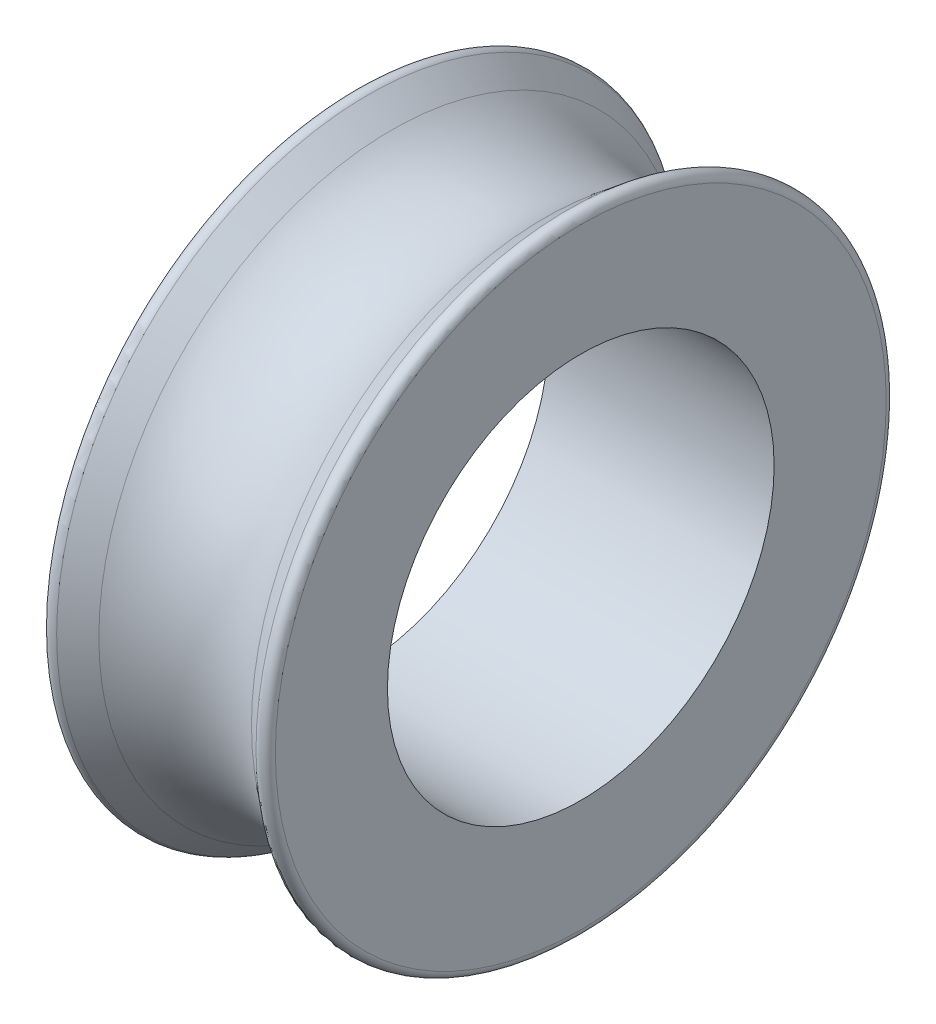
ISO-10303-21;
HEADER;
FILE_DESCRIPTION(('STEP AP214'),'2;1');
FILE_NAME('part.step','',(''),(''),'','','');
FILE_SCHEMA(('AUTOMOTIVE_DESIGN { 1 0 10303 214 1 1 1 1 }'));
ENDSEC;
DATA;
#1=APPLICATION_CONTEXT('core data for automotive mechanical design processes');
#2=APPLICATION_PROTOCOL_DEFINITION('international standard','automotive_design',2000,#1);
#3=PRODUCT_CONTEXT('',#1,'mechanical');
#4=PRODUCT('Part','Part','',(#3));
#5=PRODUCT_RELATED_PRODUCT_CATEGORY('part','',(#4));
#6=PRODUCT_DEFINITION_FORMATION('','',#4);
#7=PRODUCT_DEFINITION_CONTEXT('part definition',#1,'design');
#8=PRODUCT_DEFINITION('design','',#6,#7);
#9=PRODUCT_DEFINITION_SHAPE('','',#8);
#10=(LENGTH_UNIT() NAMED_UNIT(*) SI_UNIT(.MILLI.,.METRE.));
#11=(NAMED_UNIT(*) PLANE_ANGLE_UNIT() SI_UNIT($,.RADIAN.));
#12=(NAMED_UNIT(*) SI_UNIT($,.STERADIAN.) SOLID_ANGLE_UNIT());
#13=UNCERTAINTY_MEASURE_WITH_UNIT(LENGTH_MEASURE(1.E-05),#10,'distance_accuracy_value','');
#14=(GEOMETRIC_REPRESENTATION_CONTEXT(3) GLOBAL_UNCERTAINTY_ASSIGNED_CONTEXT((#13)) GLOBAL_UNIT_ASSIGNED_CONTEXT((#10,
#11,#12)) REPRESENTATION_CONTEXT('',''));
#15=CARTESIAN_POINT('',(0.,0.,0.));
#16=DIRECTION('',(0.,0.,1.));
#17=DIRECTION('',(1.,0.,0.));
#18=AXIS2_PLACEMENT_3D('',#15,#16,#17);
#19=CARTESIAN_POINT('',(0.,10.,0.));
#20=DIRECTION('',(1.,0.,0.));
#21=DIRECTION('',(0.,0.,-1.));
#22=AXIS2_PLACEMENT_3D('',#19,#20,#21);
#23=PLANE('',#22);
#24=CARTESIAN_POINT('',(0.,0.,0.));
#25=DIRECTION('',(-1.,0.,0.));
#26=DIRECTION('',(0.,0.,1.));
#27=AXIS2_PLACEMENT_3D('',#24,#25,#26);
#28=CIRCLE('',#27,6.);
#29=CARTESIAN_POINT('',(0.,0.,6.));
#30=VERTEX_POINT('',#29);
#31=EDGE_CURVE('E66',#30,#30,#28,.T.);
#32=ORIENTED_EDGE('',*,*,#31,.F.);
#33=EDGE_LOOP('',(#32));
#34=FACE_BOUND('',#33,.T.);
#35=CARTESIAN_POINT('',(0.,0.,0.));
#36=DIRECTION('',(1.,0.,0.));
#37=DIRECTION('',(0.,0.,-1.));
#38=AXIS2_PLACEMENT_3D('',#35,#36,#37);
#39=CIRCLE('',#38,9.47735357758255);
#40=CARTESIAN_POINT('',(0.,0.,-9.47735357758255));
#41=VERTEX_POINT('',#40);
#42=EDGE_CURVE('E44',#41,#41,#39,.F.);
#43=ORIENTED_EDGE('',*,*,#42,.T.);
#44=EDGE_LOOP('',(#43));
#45=FACE_BOUND('',#44,.T.);
#46=ADVANCED_FACE('F37',(#34,#45),#23,.F.);
#47=CARTESIAN_POINT('',(7.,0.,0.));
#48=DIRECTION('',(-1.,0.,0.));
#49=DIRECTION('',(0.,0.,1.));
#50=AXIS2_PLACEMENT_3D('',#47,#48,#49);
#51=PLANE('',#50);
#52=CARTESIAN_POINT('',(7.,0.,0.));
#53=DIRECTION('',(-1.,0.,0.));
#54=DIRECTION('',(0.,0.,1.));
#55=AXIS2_PLACEMENT_3D('',#52,#53,#54);
#56=CIRCLE('',#55,6.);
#57=CARTESIAN_POINT('',(7.,0.,6.));
#58=VERTEX_POINT('',#57);
#59=EDGE_CURVE('E63',#58,#58,#56,.F.);
#60=ORIENTED_EDGE('',*,*,#59,.F.);
#61=EDGE_LOOP('',(#60));
#62=FACE_BOUND('',#61,.T.);
#63=CARTESIAN_POINT('',(7.,0.,0.));
#64=DIRECTION('',(-1.,0.,0.));
#65=DIRECTION('',(0.,0.,1.));
#66=AXIS2_PLACEMENT_3D('',#63,#64,#65);
#67=CIRCLE('',#66,9.47735357758256);
#68=CARTESIAN_POINT('',(7.,0.,9.47735357758256));
#69=VERTEX_POINT('',#68);
#70=EDGE_CURVE('E48',#69,#69,#67,.F.);
#71=ORIENTED_EDGE('',*,*,#70,.T.);
#72=EDGE_LOOP('',(#71));
#73=FACE_BOUND('',#72,.T.);
#74=ADVANCED_FACE('F74',(#62,#73),#51,.F.);
#75=CARTESIAN_POINT('',(7.,0.,0.));
#76=DIRECTION('',(1.,0.,0.));
#77=DIRECTION('',(0.,0.,-1.));
#78=AXIS2_PLACEMENT_3D('',#75,#76,#77);
#79=CONICAL_SURFACE('',#78,10.,0.678464808980954);
#80=CARTESIAN_POINT('',(6.59310035978507,0.,0.));
#81=DIRECTION('',(-1.,0.,0.));
#82=DIRECTION('',(0.,0.,1.));
#83=AXIS2_PLACEMENT_3D('',#80,#81,#82);
#84=CIRCLE('',#83,9.67198785745233);
#85=CARTESIAN_POINT('',(6.59310035978507,0.,9.67198785745233));
#86=VERTEX_POINT('',#85);
#87=EDGE_CURVE('E52',#86,#86,#84,.T.);
#88=ORIENTED_EDGE('',*,*,#87,.T.);
#89=EDGE_LOOP('',(#88));
#90=FACE_BOUND('',#89,.T.);
#91=CARTESIAN_POINT('',(5.86817492293106,0.,0.));
#92=DIRECTION('',(-1.,0.,0.));
#93=DIRECTION('',(0.,0.,1.));
#94=AXIS2_PLACEMENT_3D('',#91,#92,#93);
#95=CIRCLE('',#94,9.08760703665782);
#96=CARTESIAN_POINT('',(5.86817492293106,0.,9.08760703665782));
#97=VERTEX_POINT('',#96);
#98=EDGE_CURVE('E57',#97,#97,#95,.T.);
#99=ORIENTED_EDGE('',*,*,#98,.F.);
#100=EDGE_LOOP('',(#99));
#101=FACE_BOUND('',#100,.T.);
#102=ADVANCED_FACE('F80',(#90,#101),#79,.T.);
#103=CARTESIAN_POINT('',(3.5,0.,0.));
#104=DIRECTION('',(-1.,0.,0.));
#105=DIRECTION('',(0.,0.,1.));
#106=AXIS2_PLACEMENT_3D('',#103,#104,#105);
#107=TOROIDAL_SURFACE('',#106,12.0253321971421,3.77339125776034);
#108=CARTESIAN_POINT('',(1.13182507706894,0.,0.));
#109=DIRECTION('',(-1.,0.,0.));
#110=DIRECTION('',(0.,0.,1.));
#111=AXIS2_PLACEMENT_3D('',#108,#109,#110);
#112=CIRCLE('',#111,9.08760703665782);
#113=CARTESIAN_POINT('',(1.13182507706894,0.,9.08760703665782));
#114=VERTEX_POINT('',#113);
#115=EDGE_CURVE('E60',#114,#114,#112,.T.);
#116=ORIENTED_EDGE('',*,*,#115,.F.);
#117=EDGE_LOOP('',(#116));
#118=FACE_BOUND('',#117,.T.);
#119=ORIENTED_EDGE('',*,*,#98,.T.);
#120=EDGE_LOOP('',(#119));
#121=FACE_BOUND('',#120,.T.);
#122=ADVANCED_FACE('F92',(#118,#121),#107,.F.);
#123=CARTESIAN_POINT('',(1.13182507706894,0.,0.));
#124=DIRECTION('',(-1.,0.,0.));
#125=DIRECTION('',(0.,0.,1.));
#126=AXIS2_PLACEMENT_3D('',#123,#124,#125);
#127=CONICAL_SURFACE('',#126,9.08760703665782,0.678464808980955);
#128=CARTESIAN_POINT('',(0.40689964021493,0.,0.));
#129=DIRECTION('',(1.,0.,0.));
#130=DIRECTION('',(0.,0.,-1.));
#131=AXIS2_PLACEMENT_3D('',#128,#129,#130);
#132=CIRCLE('',#131,9.67198785745233);
#133=CARTESIAN_POINT('',(0.40689964021493,0.,-9.67198785745233));
#134=VERTEX_POINT('',#133);
#135=EDGE_CURVE('E10',#134,#134,#132,.T.);
#136=ORIENTED_EDGE('',*,*,#135,.T.);
#137=EDGE_LOOP('',(#136));
#138=FACE_BOUND('',#137,.T.);
#139=ORIENTED_EDGE('',*,*,#115,.T.);
#140=EDGE_LOOP('',(#139));
#141=FACE_BOUND('',#140,.T.);
#142=ADVANCED_FACE('F86',(#138,#141),#127,.T.);
#143=CARTESIAN_POINT('',(6.75,0.,0.));
#144=DIRECTION('',(-1.,0.,0.));
#145=DIRECTION('',(0.,0.,1.));
#146=AXIS2_PLACEMENT_3D('',#143,#144,#145);
#147=TOROIDAL_SURFACE('',#146,9.47735357758256,0.25);
#148=ORIENTED_EDGE('',*,*,#70,.F.);
#149=EDGE_LOOP('',(#148));
#150=FACE_BOUND('',#149,.T.);
#151=ORIENTED_EDGE('',*,*,#87,.F.);
#152=EDGE_LOOP('',(#151));
#153=FACE_BOUND('',#152,.T.);
#154=ADVANCED_FACE('F84',(#150,#153),#147,.T.);
#155=CARTESIAN_POINT('',(0.25,0.,0.));
#156=DIRECTION('',(1.,0.,0.));
#157=DIRECTION('',(0.,0.,-1.));
#158=AXIS2_PLACEMENT_3D('',#155,#156,#157);
#159=TOROIDAL_SURFACE('',#158,9.47735357758255,0.25);
#160=ORIENTED_EDGE('',*,*,#135,.F.);
#161=EDGE_LOOP('',(#160));
#162=FACE_BOUND('',#161,.T.);
#163=ORIENTED_EDGE('',*,*,#42,.F.);
#164=EDGE_LOOP('',(#163));
#165=FACE_BOUND('',#164,.T.);
#166=ADVANCED_FACE('F39',(#162,#165),#159,.T.);
#167=CARTESIAN_POINT('',(7.001,0.,0.));
#168=DIRECTION('',(-1.,0.,0.));
#169=DIRECTION('',(0.,0.,1.));
#170=AXIS2_PLACEMENT_3D('',#167,#168,#169);
#171=CYLINDRICAL_SURFACE('',#170,6.);
#172=ORIENTED_EDGE('',*,*,#31,.T.);
#173=EDGE_LOOP('',(#172));
#174=FACE_BOUND('',#173,.T.);
#175=ORIENTED_EDGE('',*,*,#59,.T.);
#176=EDGE_LOOP('',(#175));
#177=FACE_BOUND('',#176,.T.);
#178=ADVANCED_FACE('F70',(#174,#177),#171,.F.);
#179=CLOSED_SHELL('',(#46,#74,#102,#122,#142,#154,#166,#178));
#180=MANIFOLD_SOLID_BREP('B2',#179);
#181=ADVANCED_BREP_SHAPE_REPRESENTATION('',(#18,#180),#14);
#182=SHAPE_DEFINITION_REPRESENTATION(#9,#181);
ENDSEC;
END-ISO-10303-21;
